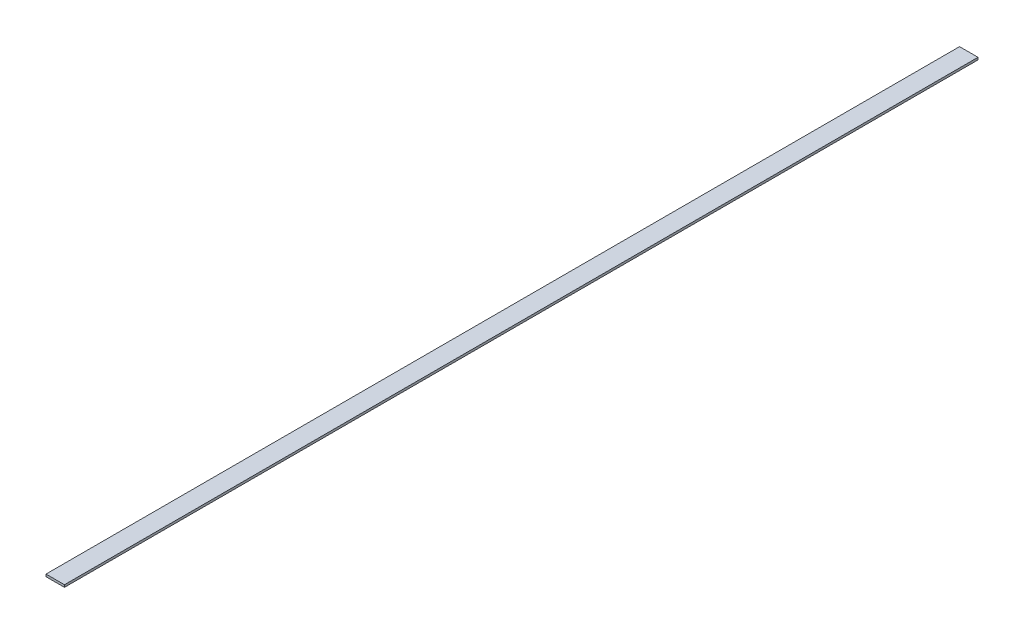
ISO-10303-21;
HEADER;
FILE_DESCRIPTION(('STEP AP214'),'2;1');
FILE_NAME('part.step','',(''),(''),'','','');
FILE_SCHEMA(('AUTOMOTIVE_DESIGN { 1 0 10303 214 1 1 1 1 }'));
ENDSEC;
DATA;
#1=APPLICATION_CONTEXT('core data for automotive mechanical design processes');
#2=APPLICATION_PROTOCOL_DEFINITION('international standard','automotive_design',2000,#1);
#3=PRODUCT_CONTEXT('',#1,'mechanical');
#4=PRODUCT('Part','Part','',(#3));
#5=PRODUCT_RELATED_PRODUCT_CATEGORY('part','',(#4));
#6=PRODUCT_DEFINITION_FORMATION('','',#4);
#7=PRODUCT_DEFINITION_CONTEXT('part definition',#1,'design');
#8=PRODUCT_DEFINITION('design','',#6,#7);
#9=PRODUCT_DEFINITION_SHAPE('','',#8);
#10=(LENGTH_UNIT() NAMED_UNIT(*) SI_UNIT(.MILLI.,.METRE.));
#11=(NAMED_UNIT(*) PLANE_ANGLE_UNIT() SI_UNIT($,.RADIAN.));
#12=(NAMED_UNIT(*) SI_UNIT($,.STERADIAN.) SOLID_ANGLE_UNIT());
#13=UNCERTAINTY_MEASURE_WITH_UNIT(LENGTH_MEASURE(1.E-05),#10,'distance_accuracy_value','');
#14=(GEOMETRIC_REPRESENTATION_CONTEXT(3) GLOBAL_UNCERTAINTY_ASSIGNED_CONTEXT((#13)) GLOBAL_UNIT_ASSIGNED_CONTEXT((#10,
#11,#12)) REPRESENTATION_CONTEXT('',''));
#15=CARTESIAN_POINT('',(0.,0.,0.));
#16=DIRECTION('',(0.,0.,1.));
#17=DIRECTION('',(1.,0.,0.));
#18=AXIS2_PLACEMENT_3D('',#15,#16,#17);
#19=CARTESIAN_POINT('',(0.,0.,1980.));
#20=DIRECTION('',(1.,0.,0.));
#21=DIRECTION('',(0.,0.,-1.));
#22=AXIS2_PLACEMENT_3D('',#19,#20,#21);
#23=PLANE('',#22);
#24=DIRECTION('',(0.,-1.,0.));
#25=VECTOR('',#24,1.);
#26=CARTESIAN_POINT('',(0.,0.,0.));
#27=LINE('',#26,#25);
#28=CARTESIAN_POINT('',(0.,5.,0.));
#29=VERTEX_POINT('',#28);
#30=CARTESIAN_POINT('',(0.,0.,0.));
#31=VERTEX_POINT('',#30);
#32=EDGE_CURVE('E96',#29,#31,#27,.T.);
#33=ORIENTED_EDGE('',*,*,#32,.T.);
#34=DIRECTION('',(0.,0.,-1.));
#35=VECTOR('',#34,1.);
#36=CARTESIAN_POINT('',(0.,0.,1980.));
#37=LINE('',#36,#35);
#38=CARTESIAN_POINT('',(0.,0.,1980.));
#39=VERTEX_POINT('',#38);
#40=EDGE_CURVE('E11',#39,#31,#37,.T.);
#41=ORIENTED_EDGE('',*,*,#40,.F.);
#42=DIRECTION('',(0.,-1.,0.));
#43=VECTOR('',#42,1.);
#44=CARTESIAN_POINT('',(0.,0.,1980.));
#45=LINE('',#44,#43);
#46=CARTESIAN_POINT('',(0.,5.,1980.));
#47=VERTEX_POINT('',#46);
#48=EDGE_CURVE('E84',#47,#39,#45,.T.);
#49=ORIENTED_EDGE('',*,*,#48,.F.);
#50=DIRECTION('',(0.,0.,-1.));
#51=VECTOR('',#50,1.);
#52=CARTESIAN_POINT('',(0.,5.,1980.));
#53=LINE('',#52,#51);
#54=EDGE_CURVE('E92',#47,#29,#53,.T.);
#55=ORIENTED_EDGE('',*,*,#54,.T.);
#56=EDGE_LOOP('',(#33,#41,#49,#55));
#57=FACE_BOUND('',#56,.T.);
#58=ADVANCED_FACE('F33',(#57),#23,.F.);
#59=CARTESIAN_POINT('',(0.,0.,1980.));
#60=DIRECTION('',(0.,1.,0.));
#61=DIRECTION('',(0.,0.,1.));
#62=AXIS2_PLACEMENT_3D('',#59,#60,#61);
#63=PLANE('',#62);
#64=DIRECTION('',(1.,0.,0.));
#65=VECTOR('',#64,1.);
#66=CARTESIAN_POINT('',(0.,0.,0.));
#67=LINE('',#66,#65);
#68=CARTESIAN_POINT('',(40.,0.,0.));
#69=VERTEX_POINT('',#68);
#70=EDGE_CURVE('E88',#31,#69,#67,.T.);
#71=ORIENTED_EDGE('',*,*,#70,.T.);
#72=DIRECTION('',(0.,0.,-1.));
#73=VECTOR('',#72,1.);
#74=CARTESIAN_POINT('',(40.,0.,1980.));
#75=LINE('',#74,#73);
#76=CARTESIAN_POINT('',(40.,0.,1980.));
#77=VERTEX_POINT('',#76);
#78=EDGE_CURVE('E41',#77,#69,#75,.T.);
#79=ORIENTED_EDGE('',*,*,#78,.F.);
#80=DIRECTION('',(1.,0.,0.));
#81=VECTOR('',#80,1.);
#82=CARTESIAN_POINT('',(0.,0.,1980.));
#83=LINE('',#82,#81);
#84=EDGE_CURVE('E79',#39,#77,#83,.T.);
#85=ORIENTED_EDGE('',*,*,#84,.F.);
#86=ORIENTED_EDGE('',*,*,#40,.T.);
#87=EDGE_LOOP('',(#71,#79,#85,#86));
#88=FACE_BOUND('',#87,.T.);
#89=ADVANCED_FACE('F87',(#88),#63,.F.);
#90=CARTESIAN_POINT('',(40.,0.,1980.));
#91=DIRECTION('',(-1.,0.,0.));
#92=DIRECTION('',(0.,0.,1.));
#93=AXIS2_PLACEMENT_3D('',#90,#91,#92);
#94=PLANE('',#93);
#95=DIRECTION('',(0.,1.,0.));
#96=VECTOR('',#95,1.);
#97=CARTESIAN_POINT('',(40.,0.,0.));
#98=LINE('',#97,#96);
#99=CARTESIAN_POINT('',(40.,5.,0.));
#100=VERTEX_POINT('',#99);
#101=EDGE_CURVE('E66',#69,#100,#98,.T.);
#102=ORIENTED_EDGE('',*,*,#101,.T.);
#103=DIRECTION('',(0.,0.,-1.));
#104=VECTOR('',#103,1.);
#105=CARTESIAN_POINT('',(40.,5.,1980.));
#106=LINE('',#105,#104);
#107=CARTESIAN_POINT('',(40.,5.,1980.));
#108=VERTEX_POINT('',#107);
#109=EDGE_CURVE('E89',#108,#100,#106,.T.);
#110=ORIENTED_EDGE('',*,*,#109,.F.);
#111=DIRECTION('',(0.,1.,0.));
#112=VECTOR('',#111,1.);
#113=CARTESIAN_POINT('',(40.,0.,1980.));
#114=LINE('',#113,#112);
#115=EDGE_CURVE('E82',#77,#108,#114,.T.);
#116=ORIENTED_EDGE('',*,*,#115,.F.);
#117=ORIENTED_EDGE('',*,*,#78,.T.);
#118=EDGE_LOOP('',(#102,#110,#116,#117));
#119=FACE_BOUND('',#118,.T.);
#120=ADVANCED_FACE('F90',(#119),#94,.F.);
#121=CARTESIAN_POINT('',(0.,5.,1980.));
#122=DIRECTION('',(0.,-1.,0.));
#123=DIRECTION('',(0.,0.,-1.));
#124=AXIS2_PLACEMENT_3D('',#121,#122,#123);
#125=PLANE('',#124);
#126=DIRECTION('',(-1.,0.,0.));
#127=VECTOR('',#126,1.);
#128=CARTESIAN_POINT('',(0.,5.,0.));
#129=LINE('',#128,#127);
#130=EDGE_CURVE('E72',#100,#29,#129,.T.);
#131=ORIENTED_EDGE('',*,*,#130,.T.);
#132=ORIENTED_EDGE('',*,*,#54,.F.);
#133=DIRECTION('',(-1.,0.,0.));
#134=VECTOR('',#133,1.);
#135=CARTESIAN_POINT('',(0.,5.,1980.));
#136=LINE('',#135,#134);
#137=EDGE_CURVE('E49',#108,#47,#136,.T.);
#138=ORIENTED_EDGE('',*,*,#137,.F.);
#139=ORIENTED_EDGE('',*,*,#109,.T.);
#140=EDGE_LOOP('',(#131,#132,#138,#139));
#141=FACE_BOUND('',#140,.T.);
#142=ADVANCED_FACE('F103',(#141),#125,.F.);
#143=CARTESIAN_POINT('',(0.,0.,1980.));
#144=DIRECTION('',(0.,0.,-1.));
#145=DIRECTION('',(-1.,0.,0.));
#146=AXIS2_PLACEMENT_3D('',#143,#144,#145);
#147=PLANE('',#146);
#148=ORIENTED_EDGE('',*,*,#48,.T.);
#149=ORIENTED_EDGE('',*,*,#84,.T.);
#150=ORIENTED_EDGE('',*,*,#115,.T.);
#151=ORIENTED_EDGE('',*,*,#137,.T.);
#152=EDGE_LOOP('',(#148,#149,#150,#151));
#153=FACE_BOUND('',#152,.T.);
#154=ADVANCED_FACE('F80',(#153),#147,.F.);
#155=CARTESIAN_POINT('',(0.,0.,0.));
#156=DIRECTION('',(0.,0.,-1.));
#157=DIRECTION('',(-1.,0.,0.));
#158=AXIS2_PLACEMENT_3D('',#155,#156,#157);
#159=PLANE('',#158);
#160=ORIENTED_EDGE('',*,*,#32,.F.);
#161=ORIENTED_EDGE('',*,*,#130,.F.);
#162=ORIENTED_EDGE('',*,*,#101,.F.);
#163=ORIENTED_EDGE('',*,*,#70,.F.);
#164=EDGE_LOOP('',(#160,#161,#162,#163));
#165=FACE_BOUND('',#164,.T.);
#166=ADVANCED_FACE('F106',(#165),#159,.T.);
#167=CLOSED_SHELL('',(#58,#89,#120,#142,#154,#166));
#168=MANIFOLD_SOLID_BREP('B2',#167);
#169=ADVANCED_BREP_SHAPE_REPRESENTATION('',(#18,#168),#14);
#170=SHAPE_DEFINITION_REPRESENTATION(#9,#169);
ENDSEC;
END-ISO-10303-21;
